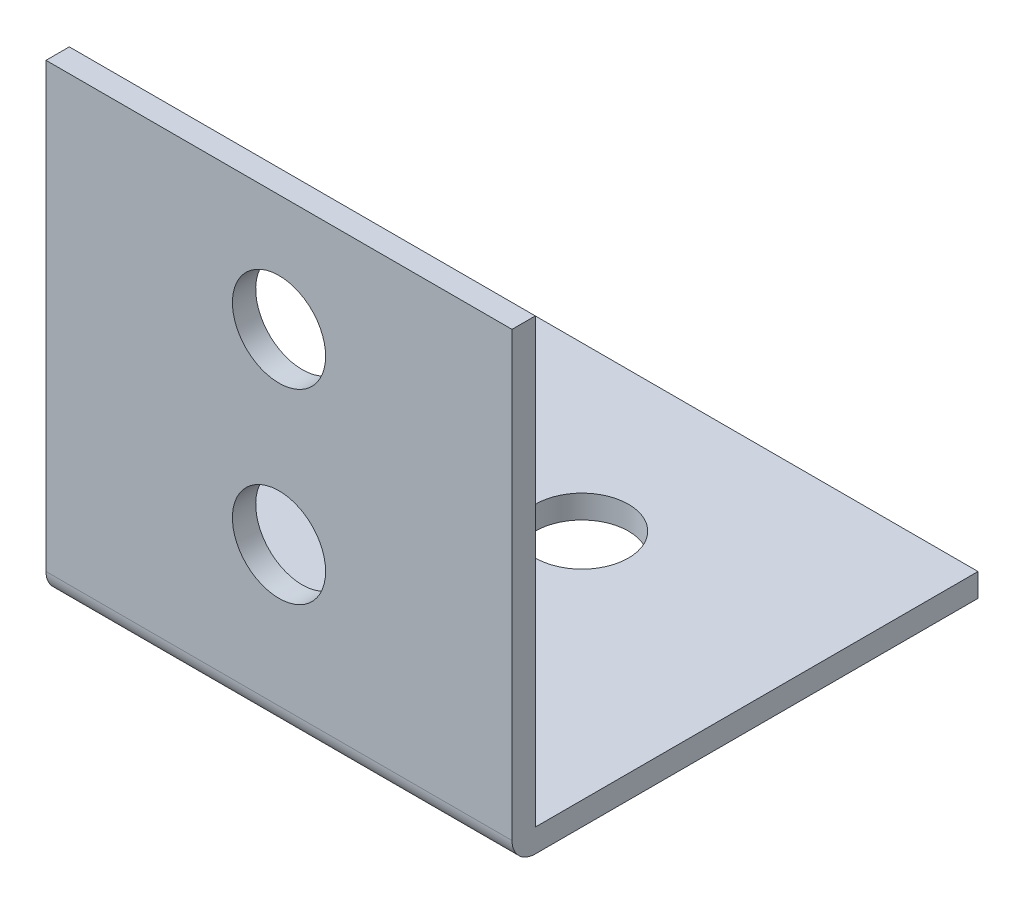
ISO-10303-21;
HEADER;
FILE_DESCRIPTION(('STEP AP214'),'2;1');
FILE_NAME('part.step','',(''),(''),'','','');
FILE_SCHEMA(('AUTOMOTIVE_DESIGN { 1 0 10303 214 1 1 1 1 }'));
ENDSEC;
DATA;
#1=APPLICATION_CONTEXT('core data for automotive mechanical design processes');
#2=APPLICATION_PROTOCOL_DEFINITION('international standard','automotive_design',2000,#1);
#3=PRODUCT_CONTEXT('',#1,'mechanical');
#4=PRODUCT('Part','Part','',(#3));
#5=PRODUCT_RELATED_PRODUCT_CATEGORY('part','',(#4));
#6=PRODUCT_DEFINITION_FORMATION('','',#4);
#7=PRODUCT_DEFINITION_CONTEXT('part definition',#1,'design');
#8=PRODUCT_DEFINITION('design','',#6,#7);
#9=PRODUCT_DEFINITION_SHAPE('','',#8);
#10=(LENGTH_UNIT() NAMED_UNIT(*) SI_UNIT(.MILLI.,.METRE.));
#11=(NAMED_UNIT(*) PLANE_ANGLE_UNIT() SI_UNIT($,.RADIAN.));
#12=(NAMED_UNIT(*) SI_UNIT($,.STERADIAN.) SOLID_ANGLE_UNIT());
#13=UNCERTAINTY_MEASURE_WITH_UNIT(LENGTH_MEASURE(1.E-05),#10,'distance_accuracy_value','');
#14=(GEOMETRIC_REPRESENTATION_CONTEXT(3) GLOBAL_UNCERTAINTY_ASSIGNED_CONTEXT((#13)) GLOBAL_UNIT_ASSIGNED_CONTEXT((#10,
#11,#12)) REPRESENTATION_CONTEXT('',''));
#15=CARTESIAN_POINT('',(0.,0.,0.));
#16=DIRECTION('',(0.,0.,1.));
#17=DIRECTION('',(1.,0.,0.));
#18=AXIS2_PLACEMENT_3D('',#15,#16,#17);
#19=CARTESIAN_POINT('',(10.,1.,-20.));
#20=DIRECTION('',(0.,0.,1.));
#21=DIRECTION('',(1.,0.,0.));
#22=AXIS2_PLACEMENT_3D('',#19,#20,#21);
#23=PLANE('',#22);
#24=DIRECTION('',(0.,1.,0.));
#25=VECTOR('',#24,1.);
#26=CARTESIAN_POINT('',(-10.,1.,-20.));
#27=LINE('',#26,#25);
#28=CARTESIAN_POINT('',(-10.,0.,-20.));
#29=VERTEX_POINT('',#28);
#30=CARTESIAN_POINT('',(-10.,1.,-20.));
#31=VERTEX_POINT('',#30);
#32=EDGE_CURVE('E126',#29,#31,#27,.T.);
#33=ORIENTED_EDGE('',*,*,#32,.T.);
#34=DIRECTION('',(-1.,0.,0.));
#35=VECTOR('',#34,1.);
#36=CARTESIAN_POINT('',(10.,1.,-20.));
#37=LINE('',#36,#35);
#38=CARTESIAN_POINT('',(10.,1.,-20.));
#39=VERTEX_POINT('',#38);
#40=EDGE_CURVE('E11',#39,#31,#37,.T.);
#41=ORIENTED_EDGE('',*,*,#40,.F.);
#42=DIRECTION('',(0.,1.,0.));
#43=VECTOR('',#42,1.);
#44=CARTESIAN_POINT('',(10.,1.,-20.));
#45=LINE('',#44,#43);
#46=CARTESIAN_POINT('',(10.,0.,-20.));
#47=VERTEX_POINT('',#46);
#48=EDGE_CURVE('E139',#47,#39,#45,.T.);
#49=ORIENTED_EDGE('',*,*,#48,.F.);
#50=DIRECTION('',(-1.,0.,0.));
#51=VECTOR('',#50,1.);
#52=CARTESIAN_POINT('',(10.,0.,-20.));
#53=LINE('',#52,#51);
#54=EDGE_CURVE('E122',#47,#29,#53,.T.);
#55=ORIENTED_EDGE('',*,*,#54,.T.);
#56=EDGE_LOOP('',(#33,#41,#49,#55));
#57=FACE_BOUND('',#56,.T.);
#58=ADVANCED_FACE('F36',(#57),#23,.F.);
#59=CARTESIAN_POINT('',(10.,1.,-20.));
#60=DIRECTION('',(0.,-1.,0.));
#61=DIRECTION('',(0.,0.,-1.));
#62=AXIS2_PLACEMENT_3D('',#59,#60,#61);
#63=PLANE('',#62);
#64=CARTESIAN_POINT('',(0.,1.,-13.));
#65=DIRECTION('',(0.,-1.,0.));
#66=DIRECTION('',(0.,0.,-1.));
#67=AXIS2_PLACEMENT_3D('',#64,#65,#66);
#68=CIRCLE('',#67,2.);
#69=CARTESIAN_POINT('',(0.,1.,-15.));
#70=VERTEX_POINT('',#69);
#71=EDGE_CURVE('E171',#70,#70,#68,.T.);
#72=ORIENTED_EDGE('',*,*,#71,.T.);
#73=EDGE_LOOP('',(#72));
#74=FACE_BOUND('',#73,.T.);
#75=CARTESIAN_POINT('',(0.,0.999999999999997,-5.));
#76=DIRECTION('',(0.,-1.,0.));
#77=DIRECTION('',(0.,0.,-1.));
#78=AXIS2_PLACEMENT_3D('',#75,#76,#77);
#79=CIRCLE('',#78,2.);
#80=CARTESIAN_POINT('',(0.,0.999999999999998,-7.));
#81=VERTEX_POINT('',#80);
#82=EDGE_CURVE('E176',#81,#81,#79,.T.);
#83=ORIENTED_EDGE('',*,*,#82,.T.);
#84=EDGE_LOOP('',(#83));
#85=FACE_BOUND('',#84,.T.);
#86=DIRECTION('',(0.,0.,1.));
#87=VECTOR('',#86,1.);
#88=CARTESIAN_POINT('',(-10.,1.,-20.));
#89=LINE('',#88,#87);
#90=CARTESIAN_POINT('',(-10.,0.999999999999998,-1.));
#91=VERTEX_POINT('',#90);
#92=EDGE_CURVE('E129',#31,#91,#89,.T.);
#93=ORIENTED_EDGE('',*,*,#92,.T.);
#94=DIRECTION('',(-1.,0.,0.));
#95=VECTOR('',#94,1.);
#96=CARTESIAN_POINT('',(10.,0.999999999999998,-1.));
#97=LINE('',#96,#95);
#98=CARTESIAN_POINT('',(10.,0.999999999999998,-1.));
#99=VERTEX_POINT('',#98);
#100=EDGE_CURVE('E44',#99,#91,#97,.T.);
#101=ORIENTED_EDGE('',*,*,#100,.F.);
#102=DIRECTION('',(0.,0.,1.));
#103=VECTOR('',#102,1.);
#104=CARTESIAN_POINT('',(10.,1.,-20.));
#105=LINE('',#104,#103);
#106=EDGE_CURVE('E92',#39,#99,#105,.T.);
#107=ORIENTED_EDGE('',*,*,#106,.F.);
#108=ORIENTED_EDGE('',*,*,#40,.T.);
#109=EDGE_LOOP('',(#93,#101,#107,#108));
#110=FACE_BOUND('',#109,.T.);
#111=ADVANCED_FACE('F202',(#74,#85,#110),#63,.F.);
#112=CARTESIAN_POINT('',(10.,0.999999999999998,-1.));
#113=DIRECTION('',(0.,0.,1.));
#114=DIRECTION('',(0.,-1.,0.));
#115=AXIS2_PLACEMENT_3D('',#112,#113,#114);
#116=PLANE('',#115);
#117=CARTESIAN_POINT('',(0.,7.,-1.));
#118=DIRECTION('',(0.,0.,1.));
#119=DIRECTION('',(0.,-1.,0.));
#120=AXIS2_PLACEMENT_3D('',#117,#118,#119);
#121=CIRCLE('',#120,2.);
#122=CARTESIAN_POINT('',(0.,5.,-1.));
#123=VERTEX_POINT('',#122);
#124=EDGE_CURVE('E130',#123,#123,#121,.T.);
#125=ORIENTED_EDGE('',*,*,#124,.T.);
#126=EDGE_LOOP('',(#125));
#127=FACE_BOUND('',#126,.T.);
#128=CARTESIAN_POINT('',(0.,15.,-1.));
#129=DIRECTION('',(0.,0.,1.));
#130=DIRECTION('',(0.,-1.,0.));
#131=AXIS2_PLACEMENT_3D('',#128,#129,#130);
#132=CIRCLE('',#131,2.);
#133=CARTESIAN_POINT('',(0.,13.,-1.));
#134=VERTEX_POINT('',#133);
#135=EDGE_CURVE('E164',#134,#134,#132,.T.);
#136=ORIENTED_EDGE('',*,*,#135,.T.);
#137=EDGE_LOOP('',(#136));
#138=FACE_BOUND('',#137,.T.);
#139=DIRECTION('',(0.,1.,0.));
#140=VECTOR('',#139,1.);
#141=CARTESIAN_POINT('',(-10.,0.999999999999998,-1.));
#142=LINE('',#141,#140);
#143=CARTESIAN_POINT('',(-10.,20.,-1.));
#144=VERTEX_POINT('',#143);
#145=EDGE_CURVE('E132',#91,#144,#142,.T.);
#146=ORIENTED_EDGE('',*,*,#145,.T.);
#147=DIRECTION('',(-1.,0.,0.));
#148=VECTOR('',#147,1.);
#149=CARTESIAN_POINT('',(10.,20.,-1.));
#150=LINE('',#149,#148);
#151=CARTESIAN_POINT('',(10.,20.,-1.));
#152=VERTEX_POINT('',#151);
#153=EDGE_CURVE('E143',#152,#144,#150,.T.);
#154=ORIENTED_EDGE('',*,*,#153,.F.);
#155=DIRECTION('',(0.,1.,0.));
#156=VECTOR('',#155,1.);
#157=CARTESIAN_POINT('',(10.,0.999999999999998,-1.));
#158=LINE('',#157,#156);
#159=EDGE_CURVE('E151',#99,#152,#158,.T.);
#160=ORIENTED_EDGE('',*,*,#159,.F.);
#161=ORIENTED_EDGE('',*,*,#100,.T.);
#162=EDGE_LOOP('',(#146,#154,#160,#161));
#163=FACE_BOUND('',#162,.T.);
#164=ADVANCED_FACE('F149',(#127,#138,#163),#116,.F.);
#165=CARTESIAN_POINT('',(10.,20.,0.));
#166=DIRECTION('',(0.,-1.,0.));
#167=DIRECTION('',(0.,0.,-1.));
#168=AXIS2_PLACEMENT_3D('',#165,#166,#167);
#169=PLANE('',#168);
#170=DIRECTION('',(0.,0.,1.));
#171=VECTOR('',#170,1.);
#172=CARTESIAN_POINT('',(-10.,20.,0.));
#173=LINE('',#172,#171);
#174=CARTESIAN_POINT('',(-10.,20.,0.));
#175=VERTEX_POINT('',#174);
#176=EDGE_CURVE('E134',#144,#175,#173,.T.);
#177=ORIENTED_EDGE('',*,*,#176,.T.);
#178=DIRECTION('',(-1.,0.,0.));
#179=VECTOR('',#178,1.);
#180=CARTESIAN_POINT('',(10.,20.,0.));
#181=LINE('',#180,#179);
#182=CARTESIAN_POINT('',(10.,20.,0.));
#183=VERTEX_POINT('',#182);
#184=EDGE_CURVE('E117',#183,#175,#181,.T.);
#185=ORIENTED_EDGE('',*,*,#184,.F.);
#186=DIRECTION('',(0.,0.,1.));
#187=VECTOR('',#186,1.);
#188=CARTESIAN_POINT('',(10.,20.,0.));
#189=LINE('',#188,#187);
#190=EDGE_CURVE('E108',#152,#183,#189,.T.);
#191=ORIENTED_EDGE('',*,*,#190,.F.);
#192=ORIENTED_EDGE('',*,*,#153,.T.);
#193=EDGE_LOOP('',(#177,#185,#191,#192));
#194=FACE_BOUND('',#193,.T.);
#195=ADVANCED_FACE('F157',(#194),#169,.F.);
#196=CARTESIAN_POINT('',(10.,0.999999999999998,0.));
#197=DIRECTION('',(0.,0.,-1.));
#198=DIRECTION('',(-1.,0.,0.));
#199=AXIS2_PLACEMENT_3D('',#196,#197,#198);
#200=PLANE('',#199);
#201=CARTESIAN_POINT('',(0.,7.,0.));
#202=DIRECTION('',(0.,0.,1.));
#203=DIRECTION('',(1.,0.,0.));
#204=AXIS2_PLACEMENT_3D('',#201,#202,#203);
#205=CIRCLE('',#204,2.);
#206=CARTESIAN_POINT('',(2.,7.,0.));
#207=VERTEX_POINT('',#206);
#208=EDGE_CURVE('E167',#207,#207,#205,.T.);
#209=ORIENTED_EDGE('',*,*,#208,.F.);
#210=EDGE_LOOP('',(#209));
#211=FACE_BOUND('',#210,.T.);
#212=CARTESIAN_POINT('',(0.,15.,0.));
#213=DIRECTION('',(0.,0.,1.));
#214=DIRECTION('',(1.,0.,0.));
#215=AXIS2_PLACEMENT_3D('',#212,#213,#214);
#216=CIRCLE('',#215,2.);
#217=CARTESIAN_POINT('',(2.,15.,0.));
#218=VERTEX_POINT('',#217);
#219=EDGE_CURVE('E168',#218,#218,#216,.T.);
#220=ORIENTED_EDGE('',*,*,#219,.F.);
#221=EDGE_LOOP('',(#220));
#222=FACE_BOUND('',#221,.T.);
#223=DIRECTION('',(0.,-1.,0.));
#224=VECTOR('',#223,1.);
#225=CARTESIAN_POINT('',(-10.,0.999999999999998,0.));
#226=LINE('',#225,#224);
#227=CARTESIAN_POINT('',(-10.,0.999999999999998,0.));
#228=VERTEX_POINT('',#227);
#229=EDGE_CURVE('E116',#175,#228,#226,.T.);
#230=ORIENTED_EDGE('',*,*,#229,.T.);
#231=DIRECTION('',(-1.,0.,0.));
#232=VECTOR('',#231,1.);
#233=CARTESIAN_POINT('',(10.,0.999999999999998,0.));
#234=LINE('',#233,#232);
#235=CARTESIAN_POINT('',(10.,0.999999999999998,0.));
#236=VERTEX_POINT('',#235);
#237=EDGE_CURVE('E113',#236,#228,#234,.T.);
#238=ORIENTED_EDGE('',*,*,#237,.F.);
#239=DIRECTION('',(0.,-1.,0.));
#240=VECTOR('',#239,1.);
#241=CARTESIAN_POINT('',(10.,0.999999999999998,0.));
#242=LINE('',#241,#240);
#243=EDGE_CURVE('E102',#183,#236,#242,.T.);
#244=ORIENTED_EDGE('',*,*,#243,.F.);
#245=ORIENTED_EDGE('',*,*,#184,.T.);
#246=EDGE_LOOP('',(#230,#238,#244,#245));
#247=FACE_BOUND('',#246,.T.);
#248=ADVANCED_FACE('F114',(#211,#222,#247),#200,.F.);
#249=CARTESIAN_POINT('',(10.,0.999999999999998,-1.));
#250=DIRECTION('',(-1.,0.,0.));
#251=DIRECTION('',(0.,0.,1.));
#252=AXIS2_PLACEMENT_3D('',#249,#250,#251);
#253=CYLINDRICAL_SURFACE('',#252,1.);
#254=CARTESIAN_POINT('',(-10.,0.999999999999998,-1.));
#255=DIRECTION('',(1.,0.,0.));
#256=DIRECTION('',(0.,0.,1.));
#257=AXIS2_PLACEMENT_3D('',#254,#255,#256);
#258=CIRCLE('',#257,1.);
#259=CARTESIAN_POINT('',(-10.,0.,-1.));
#260=VERTEX_POINT('',#259);
#261=EDGE_CURVE('E78',#228,#260,#258,.T.);
#262=ORIENTED_EDGE('',*,*,#261,.T.);
#263=DIRECTION('',(-1.,0.,0.));
#264=VECTOR('',#263,1.);
#265=CARTESIAN_POINT('',(10.,0.,-1.));
#266=LINE('',#265,#264);
#267=CARTESIAN_POINT('',(10.,0.,-1.));
#268=VERTEX_POINT('',#267);
#269=EDGE_CURVE('E118',#268,#260,#266,.T.);
#270=ORIENTED_EDGE('',*,*,#269,.F.);
#271=CARTESIAN_POINT('',(10.,0.999999999999998,-1.));
#272=DIRECTION('',(1.,0.,0.));
#273=DIRECTION('',(0.,0.,1.));
#274=AXIS2_PLACEMENT_3D('',#271,#272,#273);
#275=CIRCLE('',#274,1.);
#276=EDGE_CURVE('E106',#236,#268,#275,.T.);
#277=ORIENTED_EDGE('',*,*,#276,.F.);
#278=ORIENTED_EDGE('',*,*,#237,.T.);
#279=EDGE_LOOP('',(#262,#270,#277,#278));
#280=FACE_BOUND('',#279,.T.);
#281=ADVANCED_FACE('F120',(#280),#253,.T.);
#282=CARTESIAN_POINT('',(10.,0.,-20.));
#283=DIRECTION('',(0.,1.,0.));
#284=DIRECTION('',(0.,0.,1.));
#285=AXIS2_PLACEMENT_3D('',#282,#283,#284);
#286=PLANE('',#285);
#287=CARTESIAN_POINT('',(0.,0.,-13.));
#288=DIRECTION('',(0.,-1.,0.));
#289=DIRECTION('',(0.,0.,-1.));
#290=AXIS2_PLACEMENT_3D('',#287,#288,#289);
#291=CIRCLE('',#290,2.);
#292=CARTESIAN_POINT('',(0.,0.,-15.));
#293=VERTEX_POINT('',#292);
#294=EDGE_CURVE('E179',#293,#293,#291,.T.);
#295=ORIENTED_EDGE('',*,*,#294,.F.);
#296=EDGE_LOOP('',(#295));
#297=FACE_BOUND('',#296,.T.);
#298=CARTESIAN_POINT('',(0.,0.,-5.));
#299=DIRECTION('',(0.,-1.,0.));
#300=DIRECTION('',(0.,0.,-1.));
#301=AXIS2_PLACEMENT_3D('',#298,#299,#300);
#302=CIRCLE('',#301,2.);
#303=CARTESIAN_POINT('',(0.,0.,-7.));
#304=VERTEX_POINT('',#303);
#305=EDGE_CURVE('E180',#304,#304,#302,.T.);
#306=ORIENTED_EDGE('',*,*,#305,.F.);
#307=EDGE_LOOP('',(#306));
#308=FACE_BOUND('',#307,.T.);
#309=DIRECTION('',(0.,0.,-1.));
#310=VECTOR('',#309,1.);
#311=CARTESIAN_POINT('',(-10.,0.,-20.));
#312=LINE('',#311,#310);
#313=EDGE_CURVE('E84',#260,#29,#312,.T.);
#314=ORIENTED_EDGE('',*,*,#313,.T.);
#315=ORIENTED_EDGE('',*,*,#54,.F.);
#316=DIRECTION('',(0.,0.,-1.));
#317=VECTOR('',#316,1.);
#318=CARTESIAN_POINT('',(10.,0.,-20.));
#319=LINE('',#318,#317);
#320=EDGE_CURVE('E52',#268,#47,#319,.T.);
#321=ORIENTED_EDGE('',*,*,#320,.F.);
#322=ORIENTED_EDGE('',*,*,#269,.T.);
#323=EDGE_LOOP('',(#314,#315,#321,#322));
#324=FACE_BOUND('',#323,.T.);
#325=ADVANCED_FACE('F189',(#297,#308,#324),#286,.F.);
#326=CARTESIAN_POINT('',(10.,0.999999999999998,-1.));
#327=DIRECTION('',(-1.,0.,0.));
#328=DIRECTION('',(0.,0.,1.));
#329=AXIS2_PLACEMENT_3D('',#326,#327,#328);
#330=PLANE('',#329);
#331=ORIENTED_EDGE('',*,*,#48,.T.);
#332=ORIENTED_EDGE('',*,*,#106,.T.);
#333=ORIENTED_EDGE('',*,*,#159,.T.);
#334=ORIENTED_EDGE('',*,*,#190,.T.);
#335=ORIENTED_EDGE('',*,*,#243,.T.);
#336=ORIENTED_EDGE('',*,*,#276,.T.);
#337=ORIENTED_EDGE('',*,*,#320,.T.);
#338=EDGE_LOOP('',(#331,#332,#333,#334,#335,#336,#337));
#339=FACE_BOUND('',#338,.T.);
#340=ADVANCED_FACE('F104',(#339),#330,.F.);
#341=CARTESIAN_POINT('',(-10.,0.999999999999998,-1.));
#342=DIRECTION('',(-1.,0.,0.));
#343=DIRECTION('',(0.,0.,1.));
#344=AXIS2_PLACEMENT_3D('',#341,#342,#343);
#345=PLANE('',#344);
#346=ORIENTED_EDGE('',*,*,#32,.F.);
#347=ORIENTED_EDGE('',*,*,#313,.F.);
#348=ORIENTED_EDGE('',*,*,#261,.F.);
#349=ORIENTED_EDGE('',*,*,#229,.F.);
#350=ORIENTED_EDGE('',*,*,#176,.F.);
#351=ORIENTED_EDGE('',*,*,#145,.F.);
#352=ORIENTED_EDGE('',*,*,#92,.F.);
#353=EDGE_LOOP('',(#346,#347,#348,#349,#350,#351,#352));
#354=FACE_BOUND('',#353,.T.);
#355=ADVANCED_FACE('F155',(#354),#345,.T.);
#356=CARTESIAN_POINT('',(0.,15.,-20.));
#357=DIRECTION('',(0.,0.,1.));
#358=DIRECTION('',(1.,0.,0.));
#359=AXIS2_PLACEMENT_3D('',#356,#357,#358);
#360=CYLINDRICAL_SURFACE('',#359,2.);
#361=ORIENTED_EDGE('',*,*,#219,.T.);
#362=EDGE_LOOP('',(#361));
#363=FACE_BOUND('',#362,.T.);
#364=ORIENTED_EDGE('',*,*,#135,.F.);
#365=EDGE_LOOP('',(#364));
#366=FACE_BOUND('',#365,.T.);
#367=ADVANCED_FACE('F260',(#363,#366),#360,.F.);
#368=CARTESIAN_POINT('',(0.,7.,-20.));
#369=DIRECTION('',(0.,0.,1.));
#370=DIRECTION('',(1.,0.,0.));
#371=AXIS2_PLACEMENT_3D('',#368,#369,#370);
#372=CYLINDRICAL_SURFACE('',#371,2.);
#373=ORIENTED_EDGE('',*,*,#208,.T.);
#374=EDGE_LOOP('',(#373));
#375=FACE_BOUND('',#374,.T.);
#376=ORIENTED_EDGE('',*,*,#124,.F.);
#377=EDGE_LOOP('',(#376));
#378=FACE_BOUND('',#377,.T.);
#379=ADVANCED_FACE('F198',(#375,#378),#372,.F.);
#380=CARTESIAN_POINT('',(0.,20.,-5.));
#381=DIRECTION('',(0.,-1.,0.));
#382=DIRECTION('',(0.,0.,-1.));
#383=AXIS2_PLACEMENT_3D('',#380,#381,#382);
#384=CYLINDRICAL_SURFACE('',#383,2.);
#385=ORIENTED_EDGE('',*,*,#305,.T.);
#386=EDGE_LOOP('',(#385));
#387=FACE_BOUND('',#386,.T.);
#388=ORIENTED_EDGE('',*,*,#82,.F.);
#389=EDGE_LOOP('',(#388));
#390=FACE_BOUND('',#389,.T.);
#391=ADVANCED_FACE('F195',(#387,#390),#384,.F.);
#392=CARTESIAN_POINT('',(0.,20.,-13.));
#393=DIRECTION('',(0.,-1.,0.));
#394=DIRECTION('',(0.,0.,-1.));
#395=AXIS2_PLACEMENT_3D('',#392,#393,#394);
#396=CYLINDRICAL_SURFACE('',#395,2.);
#397=ORIENTED_EDGE('',*,*,#294,.T.);
#398=EDGE_LOOP('',(#397));
#399=FACE_BOUND('',#398,.T.);
#400=ORIENTED_EDGE('',*,*,#71,.F.);
#401=EDGE_LOOP('',(#400));
#402=FACE_BOUND('',#401,.T.);
#403=ADVANCED_FACE('F186',(#399,#402),#396,.F.);
#404=CLOSED_SHELL('',(#58,#111,#164,#195,#248,#281,#325,#340,#355,#367,#379,#391,#403));
#405=MANIFOLD_SOLID_BREP('B2',#404);
#406=ADVANCED_BREP_SHAPE_REPRESENTATION('',(#18,#405),#14);
#407=SHAPE_DEFINITION_REPRESENTATION(#9,#406);
ENDSEC;
END-ISO-10303-21;
